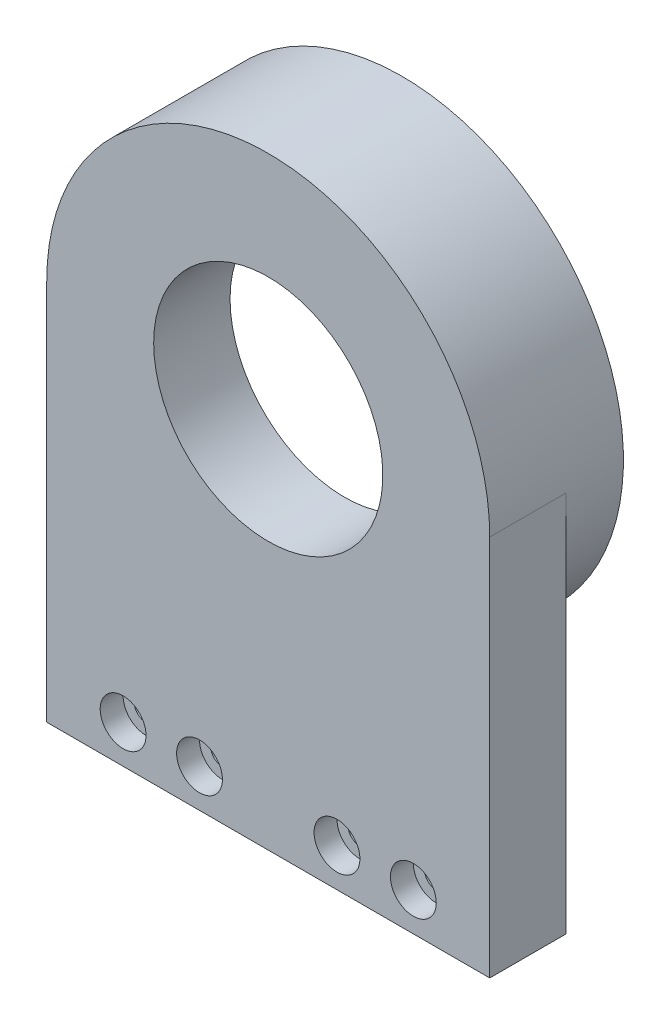
ISO-10303-21;
HEADER;
FILE_DESCRIPTION(('STEP AP214'),'2;1');
FILE_NAME('part.step','',(''),(''),'','','');
FILE_SCHEMA(('AUTOMOTIVE_DESIGN { 1 0 10303 214 1 1 1 1 }'));
ENDSEC;
DATA;
#1=APPLICATION_CONTEXT('core data for automotive mechanical design processes');
#2=APPLICATION_PROTOCOL_DEFINITION('international standard','automotive_design',2000,#1);
#3=PRODUCT_CONTEXT('',#1,'mechanical');
#4=PRODUCT('Part','Part','',(#3));
#5=PRODUCT_RELATED_PRODUCT_CATEGORY('part','',(#4));
#6=PRODUCT_DEFINITION_FORMATION('','',#4);
#7=PRODUCT_DEFINITION_CONTEXT('part definition',#1,'design');
#8=PRODUCT_DEFINITION('design','',#6,#7);
#9=PRODUCT_DEFINITION_SHAPE('','',#8);
#10=(LENGTH_UNIT() NAMED_UNIT(*) SI_UNIT(.MILLI.,.METRE.));
#11=(NAMED_UNIT(*) PLANE_ANGLE_UNIT() SI_UNIT($,.RADIAN.));
#12=(NAMED_UNIT(*) SI_UNIT($,.STERADIAN.) SOLID_ANGLE_UNIT());
#13=UNCERTAINTY_MEASURE_WITH_UNIT(LENGTH_MEASURE(1.E-05),#10,'distance_accuracy_value','');
#14=(GEOMETRIC_REPRESENTATION_CONTEXT(3) GLOBAL_UNCERTAINTY_ASSIGNED_CONTEXT((#13)) GLOBAL_UNIT_ASSIGNED_CONTEXT((#10,
#11,#12)) REPRESENTATION_CONTEXT('',''));
#15=CARTESIAN_POINT('',(0.,0.,0.));
#16=DIRECTION('',(0.,0.,1.));
#17=DIRECTION('',(1.,0.,0.));
#18=AXIS2_PLACEMENT_3D('',#15,#16,#17);
#19=CARTESIAN_POINT('',(-19.,-20.,10.001));
#20=DIRECTION('',(0.,0.,-1.));
#21=DIRECTION('',(-1.,0.,0.));
#22=AXIS2_PLACEMENT_3D('',#19,#20,#21);
#23=CYLINDRICAL_SURFACE('',#22,1.55);
#24=CARTESIAN_POINT('',(-19.,-20.,0.));
#25=DIRECTION('',(0.,0.,-1.));
#26=DIRECTION('',(1.,0.,0.));
#27=AXIS2_PLACEMENT_3D('',#24,#25,#26);
#28=CIRCLE('',#27,1.55);
#29=CARTESIAN_POINT('',(-17.45,-20.,0.));
#30=VERTEX_POINT('',#29);
#31=EDGE_CURVE('E132',#30,#30,#28,.T.);
#32=ORIENTED_EDGE('',*,*,#31,.T.);
#33=EDGE_LOOP('',(#32));
#34=FACE_BOUND('',#33,.T.);
#35=CARTESIAN_POINT('',(-19.,-20.,7.));
#36=DIRECTION('',(0.,0.,1.));
#37=DIRECTION('',(1.,0.,0.));
#38=AXIS2_PLACEMENT_3D('',#35,#36,#37);
#39=CIRCLE('',#38,1.55);
#40=CARTESIAN_POINT('',(-17.45,-20.,7.));
#41=VERTEX_POINT('',#40);
#42=EDGE_CURVE('E45',#41,#41,#39,.F.);
#43=ORIENTED_EDGE('',*,*,#42,.F.);
#44=EDGE_LOOP('',(#43));
#45=FACE_BOUND('',#44,.T.);
#46=ADVANCED_FACE('F41',(#34,#45),#23,.F.);
#47=CARTESIAN_POINT('',(-9.,-20.,10.001));
#48=DIRECTION('',(0.,0.,-1.));
#49=DIRECTION('',(-1.,0.,0.));
#50=AXIS2_PLACEMENT_3D('',#47,#48,#49);
#51=CYLINDRICAL_SURFACE('',#50,1.55);
#52=CARTESIAN_POINT('',(-9.,-20.,0.));
#53=DIRECTION('',(0.,0.,-1.));
#54=DIRECTION('',(1.,0.,0.));
#55=AXIS2_PLACEMENT_3D('',#52,#53,#54);
#56=CIRCLE('',#55,1.55);
#57=CARTESIAN_POINT('',(-7.45,-20.,0.));
#58=VERTEX_POINT('',#57);
#59=EDGE_CURVE('E136',#58,#58,#56,.T.);
#60=ORIENTED_EDGE('',*,*,#59,.T.);
#61=EDGE_LOOP('',(#60));
#62=FACE_BOUND('',#61,.T.);
#63=CARTESIAN_POINT('',(-9.,-20.,7.));
#64=DIRECTION('',(0.,0.,1.));
#65=DIRECTION('',(1.,0.,0.));
#66=AXIS2_PLACEMENT_3D('',#63,#64,#65);
#67=CIRCLE('',#66,1.55);
#68=CARTESIAN_POINT('',(-7.45,-20.,7.));
#69=VERTEX_POINT('',#68);
#70=EDGE_CURVE('E127',#69,#69,#67,.F.);
#71=ORIENTED_EDGE('',*,*,#70,.F.);
#72=EDGE_LOOP('',(#71));
#73=FACE_BOUND('',#72,.T.);
#74=ADVANCED_FACE('F171',(#62,#73),#51,.F.);
#75=CARTESIAN_POINT('',(9.,-20.,10.001));
#76=DIRECTION('',(0.,0.,-1.));
#77=DIRECTION('',(-1.,0.,0.));
#78=AXIS2_PLACEMENT_3D('',#75,#76,#77);
#79=CYLINDRICAL_SURFACE('',#78,1.55);
#80=CARTESIAN_POINT('',(9.,-20.,0.));
#81=DIRECTION('',(0.,0.,-1.));
#82=DIRECTION('',(-1.,0.,0.));
#83=AXIS2_PLACEMENT_3D('',#80,#81,#82);
#84=CIRCLE('',#83,1.55);
#85=CARTESIAN_POINT('',(7.45,-20.,0.));
#86=VERTEX_POINT('',#85);
#87=EDGE_CURVE('E141',#86,#86,#84,.T.);
#88=ORIENTED_EDGE('',*,*,#87,.T.);
#89=EDGE_LOOP('',(#88));
#90=FACE_BOUND('',#89,.T.);
#91=CARTESIAN_POINT('',(9.,-20.,7.));
#92=DIRECTION('',(0.,0.,1.));
#93=DIRECTION('',(1.,0.,0.));
#94=AXIS2_PLACEMENT_3D('',#91,#92,#93);
#95=CIRCLE('',#94,1.55);
#96=CARTESIAN_POINT('',(10.55,-20.,7.));
#97=VERTEX_POINT('',#96);
#98=EDGE_CURVE('E124',#97,#97,#95,.F.);
#99=ORIENTED_EDGE('',*,*,#98,.F.);
#100=EDGE_LOOP('',(#99));
#101=FACE_BOUND('',#100,.T.);
#102=ADVANCED_FACE('F167',(#90,#101),#79,.F.);
#103=CARTESIAN_POINT('',(19.,-20.,10.001));
#104=DIRECTION('',(0.,0.,-1.));
#105=DIRECTION('',(-1.,0.,0.));
#106=AXIS2_PLACEMENT_3D('',#103,#104,#105);
#107=CYLINDRICAL_SURFACE('',#106,1.55);
#108=CARTESIAN_POINT('',(19.,-20.,0.));
#109=DIRECTION('',(0.,0.,-1.));
#110=DIRECTION('',(-1.,0.,0.));
#111=AXIS2_PLACEMENT_3D('',#108,#109,#110);
#112=CIRCLE('',#111,1.55);
#113=CARTESIAN_POINT('',(17.45,-20.,0.));
#114=VERTEX_POINT('',#113);
#115=EDGE_CURVE('E151',#114,#114,#112,.T.);
#116=ORIENTED_EDGE('',*,*,#115,.T.);
#117=EDGE_LOOP('',(#116));
#118=FACE_BOUND('',#117,.T.);
#119=CARTESIAN_POINT('',(19.,-20.,7.));
#120=DIRECTION('',(0.,0.,1.));
#121=DIRECTION('',(1.,0.,0.));
#122=AXIS2_PLACEMENT_3D('',#119,#120,#121);
#123=CIRCLE('',#122,1.55);
#124=CARTESIAN_POINT('',(20.55,-20.,7.));
#125=VERTEX_POINT('',#124);
#126=EDGE_CURVE('E121',#125,#125,#123,.F.);
#127=ORIENTED_EDGE('',*,*,#126,.F.);
#128=EDGE_LOOP('',(#127));
#129=FACE_BOUND('',#128,.T.);
#130=ADVANCED_FACE('F161',(#118,#129),#107,.F.);
#131=CARTESIAN_POINT('',(0.,25.,10.));
#132=DIRECTION('',(0.,0.,-1.));
#133=DIRECTION('',(-1.,0.,0.));
#134=AXIS2_PLACEMENT_3D('',#131,#132,#133);
#135=CYLINDRICAL_SURFACE('',#134,29.);
#136=DIRECTION('',(0.,0.,-1.));
#137=VECTOR('',#136,1.);
#138=CARTESIAN_POINT('',(29.,25.,10.));
#139=LINE('',#138,#137);
#140=CARTESIAN_POINT('',(29.,25.,10.));
#141=VERTEX_POINT('',#140);
#142=CARTESIAN_POINT('',(29.,25.,0.));
#143=VERTEX_POINT('',#142);
#144=EDGE_CURVE('E60',#141,#143,#139,.T.);
#145=ORIENTED_EDGE('',*,*,#144,.T.);
#146=CARTESIAN_POINT('',(0.,25.,0.));
#147=DIRECTION('',(0.,0.,-1.));
#148=DIRECTION('',(-1.,0.,0.));
#149=AXIS2_PLACEMENT_3D('',#146,#147,#148);
#150=CIRCLE('',#149,29.);
#151=CARTESIAN_POINT('',(-29.,25.,0.));
#152=VERTEX_POINT('',#151);
#153=EDGE_CURVE('E51',#143,#152,#150,.T.);
#154=ORIENTED_EDGE('',*,*,#153,.T.);
#155=DIRECTION('',(0.,0.,-1.));
#156=VECTOR('',#155,1.);
#157=CARTESIAN_POINT('',(-29.,25.,10.));
#158=LINE('',#157,#156);
#159=CARTESIAN_POINT('',(-29.,25.,10.));
#160=VERTEX_POINT('',#159);
#161=EDGE_CURVE('E85',#160,#152,#158,.T.);
#162=ORIENTED_EDGE('',*,*,#161,.F.);
#163=CARTESIAN_POINT('',(0.,25.,10.));
#164=DIRECTION('',(0.,0.,1.));
#165=DIRECTION('',(1.,0.,0.));
#166=AXIS2_PLACEMENT_3D('',#163,#164,#165);
#167=CIRCLE('',#166,29.);
#168=EDGE_CURVE('E108',#160,#141,#167,.F.);
#169=ORIENTED_EDGE('',*,*,#168,.T.);
#170=EDGE_LOOP('',(#145,#154,#162,#169));
#171=FACE_BOUND('',#170,.T.);
#172=CARTESIAN_POINT('',(0.,25.,-7.5));
#173=DIRECTION('',(0.,0.,-1.));
#174=DIRECTION('',(-1.,0.,0.));
#175=AXIS2_PLACEMENT_3D('',#172,#173,#174);
#176=CIRCLE('',#175,29.);
#177=CARTESIAN_POINT('',(-29.,25.,-7.5));
#178=VERTEX_POINT('',#177);
#179=EDGE_CURVE('E96',#178,#178,#176,.T.);
#180=ORIENTED_EDGE('',*,*,#179,.F.);
#181=EDGE_LOOP('',(#180));
#182=FACE_BOUND('',#181,.T.);
#183=ADVANCED_FACE('F43',(#171,#182),#135,.T.);
#184=CARTESIAN_POINT('',(-29.,0.,10.));
#185=DIRECTION('',(1.,0.,0.));
#186=DIRECTION('',(0.,1.,0.));
#187=AXIS2_PLACEMENT_3D('',#184,#185,#186);
#188=PLANE('',#187);
#189=DIRECTION('',(0.,-1.,0.));
#190=VECTOR('',#189,1.);
#191=CARTESIAN_POINT('',(-29.,0.,0.));
#192=LINE('',#191,#190);
#193=CARTESIAN_POINT('',(-29.,-25.,0.));
#194=VERTEX_POINT('',#193);
#195=EDGE_CURVE('E90',#152,#194,#192,.T.);
#196=ORIENTED_EDGE('',*,*,#195,.T.);
#197=DIRECTION('',(0.,0.,-1.));
#198=VECTOR('',#197,1.);
#199=CARTESIAN_POINT('',(-29.,-25.,10.));
#200=LINE('',#199,#198);
#201=CARTESIAN_POINT('',(-29.,-25.,10.));
#202=VERTEX_POINT('',#201);
#203=EDGE_CURVE('E101',#202,#194,#200,.T.);
#204=ORIENTED_EDGE('',*,*,#203,.F.);
#205=DIRECTION('',(0.,-1.,0.));
#206=VECTOR('',#205,1.);
#207=CARTESIAN_POINT('',(-29.,0.,10.));
#208=LINE('',#207,#206);
#209=EDGE_CURVE('E99',#160,#202,#208,.T.);
#210=ORIENTED_EDGE('',*,*,#209,.F.);
#211=ORIENTED_EDGE('',*,*,#161,.T.);
#212=EDGE_LOOP('',(#196,#204,#210,#211));
#213=FACE_BOUND('',#212,.T.);
#214=ADVANCED_FACE('F98',(#213),#188,.F.);
#215=CARTESIAN_POINT('',(0.,-25.,10.));
#216=DIRECTION('',(0.,1.,0.));
#217=DIRECTION('',(0.,0.,1.));
#218=AXIS2_PLACEMENT_3D('',#215,#216,#217);
#219=PLANE('',#218);
#220=DIRECTION('',(1.,0.,0.));
#221=VECTOR('',#220,1.);
#222=CARTESIAN_POINT('',(0.,-25.,0.));
#223=LINE('',#222,#221);
#224=CARTESIAN_POINT('',(29.,-25.,0.));
#225=VERTEX_POINT('',#224);
#226=EDGE_CURVE('E92',#194,#225,#223,.T.);
#227=ORIENTED_EDGE('',*,*,#226,.T.);
#228=DIRECTION('',(0.,0.,-1.));
#229=VECTOR('',#228,1.);
#230=CARTESIAN_POINT('',(29.,-25.,10.));
#231=LINE('',#230,#229);
#232=CARTESIAN_POINT('',(29.,-25.,10.));
#233=VERTEX_POINT('',#232);
#234=EDGE_CURVE('E73',#233,#225,#231,.T.);
#235=ORIENTED_EDGE('',*,*,#234,.F.);
#236=DIRECTION('',(1.,0.,0.));
#237=VECTOR('',#236,1.);
#238=CARTESIAN_POINT('',(0.,-25.,10.));
#239=LINE('',#238,#237);
#240=EDGE_CURVE('E112',#202,#233,#239,.T.);
#241=ORIENTED_EDGE('',*,*,#240,.F.);
#242=ORIENTED_EDGE('',*,*,#203,.T.);
#243=EDGE_LOOP('',(#227,#235,#241,#242));
#244=FACE_BOUND('',#243,.T.);
#245=ADVANCED_FACE('F166',(#244),#219,.F.);
#246=CARTESIAN_POINT('',(29.,0.,10.));
#247=DIRECTION('',(1.,0.,0.));
#248=DIRECTION('',(0.,0.,-1.));
#249=AXIS2_PLACEMENT_3D('',#246,#247,#248);
#250=PLANE('',#249);
#251=DIRECTION('',(0.,-1.,0.));
#252=VECTOR('',#251,1.);
#253=CARTESIAN_POINT('',(29.,0.,0.));
#254=LINE('',#253,#252);
#255=EDGE_CURVE('E110',#143,#225,#254,.T.);
#256=ORIENTED_EDGE('',*,*,#255,.F.);
#257=ORIENTED_EDGE('',*,*,#144,.F.);
#258=DIRECTION('',(0.,-1.,0.));
#259=VECTOR('',#258,1.);
#260=CARTESIAN_POINT('',(29.,0.,10.));
#261=LINE('',#260,#259);
#262=EDGE_CURVE('E114',#141,#233,#261,.T.);
#263=ORIENTED_EDGE('',*,*,#262,.T.);
#264=ORIENTED_EDGE('',*,*,#234,.T.);
#265=EDGE_LOOP('',(#256,#257,#263,#264));
#266=FACE_BOUND('',#265,.T.);
#267=ADVANCED_FACE('F199',(#266),#250,.T.);
#268=CARTESIAN_POINT('',(0.,0.,10.));
#269=DIRECTION('',(0.,0.,1.));
#270=DIRECTION('',(1.,0.,0.));
#271=AXIS2_PLACEMENT_3D('',#268,#269,#270);
#272=PLANE('',#271);
#273=CARTESIAN_POINT('',(0.,25.,10.));
#274=DIRECTION('',(0.,0.,-1.));
#275=DIRECTION('',(-1.,0.,0.));
#276=AXIS2_PLACEMENT_3D('',#273,#274,#275);
#277=CIRCLE('',#276,15.);
#278=CARTESIAN_POINT('',(-15.,25.,10.));
#279=VERTEX_POINT('',#278);
#280=EDGE_CURVE('E464',#279,#279,#277,.T.);
#281=ORIENTED_EDGE('',*,*,#280,.T.);
#282=EDGE_LOOP('',(#281));
#283=FACE_BOUND('',#282,.T.);
#284=CARTESIAN_POINT('',(19.,-20.,10.));
#285=DIRECTION('',(0.,0.,1.));
#286=DIRECTION('',(1.,0.,0.));
#287=AXIS2_PLACEMENT_3D('',#284,#285,#286);
#288=CIRCLE('',#287,3.);
#289=CARTESIAN_POINT('',(22.,-20.,10.));
#290=VERTEX_POINT('',#289);
#291=EDGE_CURVE('E479',#290,#290,#288,.T.);
#292=ORIENTED_EDGE('',*,*,#291,.F.);
#293=EDGE_LOOP('',(#292));
#294=FACE_BOUND('',#293,.T.);
#295=CARTESIAN_POINT('',(9.,-20.,10.));
#296=DIRECTION('',(0.,0.,1.));
#297=DIRECTION('',(1.,0.,0.));
#298=AXIS2_PLACEMENT_3D('',#295,#296,#297);
#299=CIRCLE('',#298,3.);
#300=CARTESIAN_POINT('',(12.,-20.,10.));
#301=VERTEX_POINT('',#300);
#302=EDGE_CURVE('E476',#301,#301,#299,.T.);
#303=ORIENTED_EDGE('',*,*,#302,.F.);
#304=EDGE_LOOP('',(#303));
#305=FACE_BOUND('',#304,.T.);
#306=CARTESIAN_POINT('',(-9.,-20.,10.));
#307=DIRECTION('',(0.,0.,1.));
#308=DIRECTION('',(1.,0.,0.));
#309=AXIS2_PLACEMENT_3D('',#306,#307,#308);
#310=CIRCLE('',#309,3.);
#311=CARTESIAN_POINT('',(-6.,-20.,10.));
#312=VERTEX_POINT('',#311);
#313=EDGE_CURVE('E470',#312,#312,#310,.T.);
#314=ORIENTED_EDGE('',*,*,#313,.F.);
#315=EDGE_LOOP('',(#314));
#316=FACE_BOUND('',#315,.T.);
#317=CARTESIAN_POINT('',(-19.,-20.,10.));
#318=DIRECTION('',(0.,0.,1.));
#319=DIRECTION('',(1.,0.,0.));
#320=AXIS2_PLACEMENT_3D('',#317,#318,#319);
#321=CIRCLE('',#320,3.);
#322=CARTESIAN_POINT('',(-16.,-20.,10.));
#323=VERTEX_POINT('',#322);
#324=EDGE_CURVE('E463',#323,#323,#321,.T.);
#325=ORIENTED_EDGE('',*,*,#324,.F.);
#326=EDGE_LOOP('',(#325));
#327=FACE_BOUND('',#326,.T.);
#328=ORIENTED_EDGE('',*,*,#168,.F.);
#329=ORIENTED_EDGE('',*,*,#209,.T.);
#330=ORIENTED_EDGE('',*,*,#240,.T.);
#331=ORIENTED_EDGE('',*,*,#262,.F.);
#332=EDGE_LOOP('',(#328,#329,#330,#331));
#333=FACE_BOUND('',#332,.T.);
#334=ADVANCED_FACE('F196',(#283,#294,#305,#316,#327,#333),#272,.T.);
#335=CARTESIAN_POINT('',(0.,0.,0.));
#336=DIRECTION('',(0.,0.,1.));
#337=DIRECTION('',(1.,0.,0.));
#338=AXIS2_PLACEMENT_3D('',#335,#336,#337);
#339=PLANE('',#338);
#340=ORIENTED_EDGE('',*,*,#115,.F.);
#341=EDGE_LOOP('',(#340));
#342=FACE_BOUND('',#341,.T.);
#343=ORIENTED_EDGE('',*,*,#87,.F.);
#344=EDGE_LOOP('',(#343));
#345=FACE_BOUND('',#344,.T.);
#346=ORIENTED_EDGE('',*,*,#59,.F.);
#347=EDGE_LOOP('',(#346));
#348=FACE_BOUND('',#347,.T.);
#349=ORIENTED_EDGE('',*,*,#31,.F.);
#350=EDGE_LOOP('',(#349));
#351=FACE_BOUND('',#350,.T.);
#352=ORIENTED_EDGE('',*,*,#153,.F.);
#353=ORIENTED_EDGE('',*,*,#255,.T.);
#354=ORIENTED_EDGE('',*,*,#226,.F.);
#355=ORIENTED_EDGE('',*,*,#195,.F.);
#356=EDGE_LOOP('',(#352,#353,#354,#355));
#357=FACE_BOUND('',#356,.T.);
#358=ADVANCED_FACE('F91',(#342,#345,#348,#351,#357),#339,.F.);
#359=CARTESIAN_POINT('',(0.,25.,-7.5));
#360=DIRECTION('',(0.,0.,-1.));
#361=DIRECTION('',(-1.,0.,0.));
#362=AXIS2_PLACEMENT_3D('',#359,#360,#361);
#363=PLANE('',#362);
#364=ORIENTED_EDGE('',*,*,#179,.T.);
#365=EDGE_LOOP('',(#364));
#366=FACE_BOUND('',#365,.T.);
#367=CARTESIAN_POINT('',(0.,25.,-7.5));
#368=DIRECTION('',(0.,0.,-1.));
#369=DIRECTION('',(-1.,0.,0.));
#370=AXIS2_PLACEMENT_3D('',#367,#368,#369);
#371=CIRCLE('',#370,26.1);
#372=CARTESIAN_POINT('',(-26.1,25.,-7.5));
#373=VERTEX_POINT('',#372);
#374=EDGE_CURVE('E148',#373,#373,#371,.T.);
#375=ORIENTED_EDGE('',*,*,#374,.F.);
#376=EDGE_LOOP('',(#375));
#377=FACE_BOUND('',#376,.T.);
#378=ADVANCED_FACE('F158',(#366,#377),#363,.T.);
#379=CARTESIAN_POINT('',(0.,25.,-7.5));
#380=DIRECTION('',(0.,0.,1.));
#381=DIRECTION('',(1.,0.,0.));
#382=AXIS2_PLACEMENT_3D('',#379,#380,#381);
#383=CYLINDRICAL_SURFACE('',#382,26.1);
#384=CARTESIAN_POINT('',(0.,25.,-0.5));
#385=DIRECTION('',(0.,0.,-1.));
#386=DIRECTION('',(-1.,0.,0.));
#387=AXIS2_PLACEMENT_3D('',#384,#385,#386);
#388=CIRCLE('',#387,26.1);
#389=CARTESIAN_POINT('',(-26.1,25.,-0.5));
#390=VERTEX_POINT('',#389);
#391=EDGE_CURVE('E11',#390,#390,#388,.T.);
#392=ORIENTED_EDGE('',*,*,#391,.F.);
#393=EDGE_LOOP('',(#392));
#394=FACE_BOUND('',#393,.T.);
#395=ORIENTED_EDGE('',*,*,#374,.T.);
#396=EDGE_LOOP('',(#395));
#397=FACE_BOUND('',#396,.T.);
#398=ADVANCED_FACE('F189',(#394,#397),#383,.F.);
#399=CARTESIAN_POINT('',(0.,25.,-0.5));
#400=DIRECTION('',(0.,0.,-1.));
#401=DIRECTION('',(-1.,0.,0.));
#402=AXIS2_PLACEMENT_3D('',#399,#400,#401);
#403=PLANE('',#402);
#404=ORIENTED_EDGE('',*,*,#391,.T.);
#405=EDGE_LOOP('',(#404));
#406=FACE_BOUND('',#405,.T.);
#407=CARTESIAN_POINT('',(0.,25.,-0.5));
#408=DIRECTION('',(0.,0.,-1.));
#409=DIRECTION('',(-1.,0.,0.));
#410=AXIS2_PLACEMENT_3D('',#407,#408,#409);
#411=CIRCLE('',#410,24.);
#412=CARTESIAN_POINT('',(-24.,25.,-0.5));
#413=VERTEX_POINT('',#412);
#414=EDGE_CURVE('E145',#413,#413,#411,.T.);
#415=ORIENTED_EDGE('',*,*,#414,.F.);
#416=EDGE_LOOP('',(#415));
#417=FACE_BOUND('',#416,.T.);
#418=ADVANCED_FACE('F185',(#406,#417),#403,.T.);
#419=CARTESIAN_POINT('',(0.,25.,-0.5));
#420=DIRECTION('',(0.,0.,1.));
#421=DIRECTION('',(1.,0.,0.));
#422=AXIS2_PLACEMENT_3D('',#419,#420,#421);
#423=CYLINDRICAL_SURFACE('',#422,24.);
#424=ORIENTED_EDGE('',*,*,#414,.T.);
#425=EDGE_LOOP('',(#424));
#426=FACE_BOUND('',#425,.T.);
#427=CARTESIAN_POINT('',(0.,25.,0.));
#428=DIRECTION('',(0.,0.,-1.));
#429=DIRECTION('',(-1.,0.,0.));
#430=AXIS2_PLACEMENT_3D('',#427,#428,#429);
#431=CIRCLE('',#430,24.);
#432=CARTESIAN_POINT('',(-24.,25.,0.));
#433=VERTEX_POINT('',#432);
#434=EDGE_CURVE('E149',#433,#433,#431,.T.);
#435=ORIENTED_EDGE('',*,*,#434,.F.);
#436=EDGE_LOOP('',(#435));
#437=FACE_BOUND('',#436,.T.);
#438=ADVANCED_FACE('F181',(#426,#437),#423,.F.);
#439=CARTESIAN_POINT('',(0.,25.,0.));
#440=DIRECTION('',(0.,0.,-1.));
#441=DIRECTION('',(-1.,0.,0.));
#442=AXIS2_PLACEMENT_3D('',#439,#440,#441);
#443=CIRCLE('',#442,15.);
#444=CARTESIAN_POINT('',(-15.,25.,0.));
#445=VERTEX_POINT('',#444);
#446=EDGE_CURVE('E484',#445,#445,#443,.T.);
#447=ORIENTED_EDGE('',*,*,#446,.F.);
#448=EDGE_LOOP('',(#447));
#449=FACE_BOUND('',#448,.T.);
#450=ORIENTED_EDGE('',*,*,#434,.T.);
#451=EDGE_LOOP('',(#450));
#452=FACE_BOUND('',#451,.T.);
#453=ADVANCED_FACE('F184',(#449,#452),#339,.F.);
#454=CARTESIAN_POINT('',(19.,-20.,7.));
#455=DIRECTION('',(0.,0.,1.));
#456=DIRECTION('',(1.,0.,0.));
#457=AXIS2_PLACEMENT_3D('',#454,#455,#456);
#458=PLANE('',#457);
#459=CARTESIAN_POINT('',(19.,-20.,7.));
#460=DIRECTION('',(0.,0.,1.));
#461=DIRECTION('',(1.,0.,0.));
#462=AXIS2_PLACEMENT_3D('',#459,#460,#461);
#463=CIRCLE('',#462,3.);
#464=CARTESIAN_POINT('',(22.,-20.,7.));
#465=VERTEX_POINT('',#464);
#466=EDGE_CURVE('E125',#465,#465,#463,.T.);
#467=ORIENTED_EDGE('',*,*,#466,.T.);
#468=EDGE_LOOP('',(#467));
#469=FACE_BOUND('',#468,.T.);
#470=ORIENTED_EDGE('',*,*,#126,.T.);
#471=EDGE_LOOP('',(#470));
#472=FACE_BOUND('',#471,.T.);
#473=ADVANCED_FACE('F250',(#469,#472),#458,.T.);
#474=CARTESIAN_POINT('',(19.,-20.,7.));
#475=DIRECTION('',(0.,0.,1.));
#476=DIRECTION('',(1.,0.,0.));
#477=AXIS2_PLACEMENT_3D('',#474,#475,#476);
#478=CYLINDRICAL_SURFACE('',#477,3.);
#479=ORIENTED_EDGE('',*,*,#466,.F.);
#480=EDGE_LOOP('',(#479));
#481=FACE_BOUND('',#480,.T.);
#482=ORIENTED_EDGE('',*,*,#291,.T.);
#483=EDGE_LOOP('',(#482));
#484=FACE_BOUND('',#483,.T.);
#485=ADVANCED_FACE('F258',(#481,#484),#478,.F.);
#486=CARTESIAN_POINT('',(9.,-20.,7.));
#487=DIRECTION('',(0.,0.,1.));
#488=DIRECTION('',(1.,0.,0.));
#489=AXIS2_PLACEMENT_3D('',#486,#487,#488);
#490=PLANE('',#489);
#491=CARTESIAN_POINT('',(9.,-20.,7.));
#492=DIRECTION('',(0.,0.,1.));
#493=DIRECTION('',(1.,0.,0.));
#494=AXIS2_PLACEMENT_3D('',#491,#492,#493);
#495=CIRCLE('',#494,3.);
#496=CARTESIAN_POINT('',(12.,-20.,7.));
#497=VERTEX_POINT('',#496);
#498=EDGE_CURVE('E473',#497,#497,#495,.T.);
#499=ORIENTED_EDGE('',*,*,#498,.T.);
#500=EDGE_LOOP('',(#499));
#501=FACE_BOUND('',#500,.T.);
#502=ORIENTED_EDGE('',*,*,#98,.T.);
#503=EDGE_LOOP('',(#502));
#504=FACE_BOUND('',#503,.T.);
#505=ADVANCED_FACE('F267',(#501,#504),#490,.T.);
#506=CARTESIAN_POINT('',(9.,-20.,7.));
#507=DIRECTION('',(0.,0.,1.));
#508=DIRECTION('',(1.,0.,0.));
#509=AXIS2_PLACEMENT_3D('',#506,#507,#508);
#510=CYLINDRICAL_SURFACE('',#509,3.);
#511=ORIENTED_EDGE('',*,*,#498,.F.);
#512=EDGE_LOOP('',(#511));
#513=FACE_BOUND('',#512,.T.);
#514=ORIENTED_EDGE('',*,*,#302,.T.);
#515=EDGE_LOOP('',(#514));
#516=FACE_BOUND('',#515,.T.);
#517=ADVANCED_FACE('F275',(#513,#516),#510,.F.);
#518=CARTESIAN_POINT('',(-9.,-20.,7.));
#519=DIRECTION('',(0.,0.,1.));
#520=DIRECTION('',(1.,0.,0.));
#521=AXIS2_PLACEMENT_3D('',#518,#519,#520);
#522=PLANE('',#521);
#523=CARTESIAN_POINT('',(-9.,-20.,7.));
#524=DIRECTION('',(0.,0.,1.));
#525=DIRECTION('',(1.,0.,0.));
#526=AXIS2_PLACEMENT_3D('',#523,#524,#525);
#527=CIRCLE('',#526,3.);
#528=CARTESIAN_POINT('',(-6.,-20.,7.));
#529=VERTEX_POINT('',#528);
#530=EDGE_CURVE('E467',#529,#529,#527,.T.);
#531=ORIENTED_EDGE('',*,*,#530,.T.);
#532=EDGE_LOOP('',(#531));
#533=FACE_BOUND('',#532,.T.);
#534=ORIENTED_EDGE('',*,*,#70,.T.);
#535=EDGE_LOOP('',(#534));
#536=FACE_BOUND('',#535,.T.);
#537=ADVANCED_FACE('F283',(#533,#536),#522,.T.);
#538=CARTESIAN_POINT('',(-9.,-20.,7.));
#539=DIRECTION('',(0.,0.,1.));
#540=DIRECTION('',(1.,0.,0.));
#541=AXIS2_PLACEMENT_3D('',#538,#539,#540);
#542=CYLINDRICAL_SURFACE('',#541,3.);
#543=ORIENTED_EDGE('',*,*,#530,.F.);
#544=EDGE_LOOP('',(#543));
#545=FACE_BOUND('',#544,.T.);
#546=ORIENTED_EDGE('',*,*,#313,.T.);
#547=EDGE_LOOP('',(#546));
#548=FACE_BOUND('',#547,.T.);
#549=ADVANCED_FACE('F291',(#545,#548),#542,.F.);
#550=CARTESIAN_POINT('',(-19.,-20.,7.));
#551=DIRECTION('',(0.,0.,1.));
#552=DIRECTION('',(1.,0.,0.));
#553=AXIS2_PLACEMENT_3D('',#550,#551,#552);
#554=PLANE('',#553);
#555=CARTESIAN_POINT('',(-19.,-20.,7.));
#556=DIRECTION('',(0.,0.,1.));
#557=DIRECTION('',(1.,0.,0.));
#558=AXIS2_PLACEMENT_3D('',#555,#556,#557);
#559=CIRCLE('',#558,3.);
#560=CARTESIAN_POINT('',(-16.,-20.,7.));
#561=VERTEX_POINT('',#560);
#562=EDGE_CURVE('E460',#561,#561,#559,.T.);
#563=ORIENTED_EDGE('',*,*,#562,.T.);
#564=EDGE_LOOP('',(#563));
#565=FACE_BOUND('',#564,.T.);
#566=ORIENTED_EDGE('',*,*,#42,.T.);
#567=EDGE_LOOP('',(#566));
#568=FACE_BOUND('',#567,.T.);
#569=ADVANCED_FACE('F299',(#565,#568),#554,.T.);
#570=CARTESIAN_POINT('',(-19.,-20.,7.));
#571=DIRECTION('',(0.,0.,1.));
#572=DIRECTION('',(1.,0.,0.));
#573=AXIS2_PLACEMENT_3D('',#570,#571,#572);
#574=CYLINDRICAL_SURFACE('',#573,3.);
#575=ORIENTED_EDGE('',*,*,#562,.F.);
#576=EDGE_LOOP('',(#575));
#577=FACE_BOUND('',#576,.T.);
#578=ORIENTED_EDGE('',*,*,#324,.T.);
#579=EDGE_LOOP('',(#578));
#580=FACE_BOUND('',#579,.T.);
#581=ADVANCED_FACE('F307',(#577,#580),#574,.F.);
#582=CARTESIAN_POINT('',(0.,25.,10.));
#583=DIRECTION('',(0.,0.,-1.));
#584=DIRECTION('',(-1.,0.,0.));
#585=AXIS2_PLACEMENT_3D('',#582,#583,#584);
#586=CYLINDRICAL_SURFACE('',#585,15.);
#587=ORIENTED_EDGE('',*,*,#280,.F.);
#588=EDGE_LOOP('',(#587));
#589=FACE_BOUND('',#588,.T.);
#590=ORIENTED_EDGE('',*,*,#446,.T.);
#591=EDGE_LOOP('',(#590));
#592=FACE_BOUND('',#591,.T.);
#593=ADVANCED_FACE('F314',(#589,#592),#586,.F.);
#594=CLOSED_SHELL('',(#46,#74,#102,#130,#183,#214,#245,#267,#334,#358,#378,#398,#418,#438,#453,
#473,#485,#505,#517,#537,#549,#569,#581,#593));
#595=MANIFOLD_SOLID_BREP('B2',#594);
#596=ADVANCED_BREP_SHAPE_REPRESENTATION('',(#18,#595),#14);
#597=SHAPE_DEFINITION_REPRESENTATION(#9,#596);
ENDSEC;
END-ISO-10303-21;
